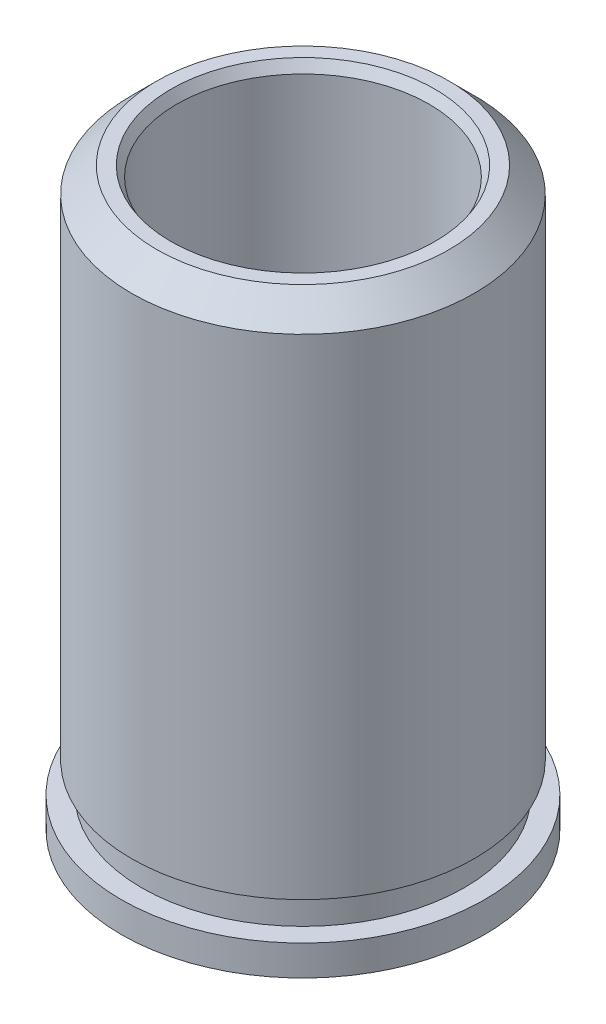
ISO-10303-21;
HEADER;
FILE_DESCRIPTION(('STEP AP214'),'2;1');
FILE_NAME('part.step','',(''),(''),'','','');
FILE_SCHEMA(('AUTOMOTIVE_DESIGN { 1 0 10303 214 1 1 1 1 }'));
ENDSEC;
DATA;
#1=APPLICATION_CONTEXT('core data for automotive mechanical design processes');
#2=APPLICATION_PROTOCOL_DEFINITION('international standard','automotive_design',2000,#1);
#3=PRODUCT_CONTEXT('',#1,'mechanical');
#4=PRODUCT('Part','Part','',(#3));
#5=PRODUCT_RELATED_PRODUCT_CATEGORY('part','',(#4));
#6=PRODUCT_DEFINITION_FORMATION('','',#4);
#7=PRODUCT_DEFINITION_CONTEXT('part definition',#1,'design');
#8=PRODUCT_DEFINITION('design','',#6,#7);
#9=PRODUCT_DEFINITION_SHAPE('','',#8);
#10=(LENGTH_UNIT() NAMED_UNIT(*) SI_UNIT(.MILLI.,.METRE.));
#11=(NAMED_UNIT(*) PLANE_ANGLE_UNIT() SI_UNIT($,.RADIAN.));
#12=(NAMED_UNIT(*) SI_UNIT($,.STERADIAN.) SOLID_ANGLE_UNIT());
#13=UNCERTAINTY_MEASURE_WITH_UNIT(LENGTH_MEASURE(1.E-05),#10,'distance_accuracy_value','');
#14=(GEOMETRIC_REPRESENTATION_CONTEXT(3) GLOBAL_UNCERTAINTY_ASSIGNED_CONTEXT((#13)) GLOBAL_UNIT_ASSIGNED_CONTEXT((#10,
#11,#12)) REPRESENTATION_CONTEXT('',''));
#15=CARTESIAN_POINT('',(0.,0.,0.));
#16=DIRECTION('',(0.,0.,1.));
#17=DIRECTION('',(1.,0.,0.));
#18=AXIS2_PLACEMENT_3D('',#15,#16,#17);
#19=CARTESIAN_POINT('',(0.,7.239,0.));
#20=DIRECTION('',(0.,1.,0.));
#21=DIRECTION('',(0.,0.,1.));
#22=AXIS2_PLACEMENT_3D('',#19,#20,#21);
#23=CYLINDRICAL_SURFACE('',#22,4.572);
#24=CARTESIAN_POINT('',(0.,-7.239,0.));
#25=DIRECTION('',(0.,1.,0.));
#26=DIRECTION('',(0.,0.,1.));
#27=AXIS2_PLACEMENT_3D('',#24,#25,#26);
#28=CIRCLE('',#27,4.572);
#29=CARTESIAN_POINT('',(0.,-7.239,4.572));
#30=VERTEX_POINT('',#29);
#31=EDGE_CURVE('E51',#30,#30,#28,.T.);
#32=ORIENTED_EDGE('',*,*,#31,.T.);
#33=EDGE_LOOP('',(#32));
#34=FACE_BOUND('',#33,.T.);
#35=CARTESIAN_POINT('',(0.,-6.477,0.));
#36=DIRECTION('',(0.,1.,0.));
#37=DIRECTION('',(0.,0.,1.));
#38=AXIS2_PLACEMENT_3D('',#35,#36,#37);
#39=CIRCLE('',#38,4.572);
#40=CARTESIAN_POINT('',(0.,-6.477,4.572));
#41=VERTEX_POINT('',#40);
#42=EDGE_CURVE('E9',#41,#41,#39,.T.);
#43=ORIENTED_EDGE('',*,*,#42,.F.);
#44=EDGE_LOOP('',(#43));
#45=FACE_BOUND('',#44,.T.);
#46=ADVANCED_FACE('F14',(#34,#45),#23,.T.);
#47=CARTESIAN_POINT('',(2.286,-6.477,0.));
#48=DIRECTION('',(0.,1.,0.));
#49=DIRECTION('',(0.,0.,1.));
#50=AXIS2_PLACEMENT_3D('',#47,#48,#49);
#51=PLANE('',#50);
#52=ORIENTED_EDGE('',*,*,#42,.T.);
#53=EDGE_LOOP('',(#52));
#54=FACE_BOUND('',#53,.T.);
#55=CARTESIAN_POINT('',(0.,-6.477,0.));
#56=DIRECTION('',(0.,1.,0.));
#57=DIRECTION('',(0.,0.,1.));
#58=AXIS2_PLACEMENT_3D('',#55,#56,#57);
#59=CIRCLE('',#58,4.05765);
#60=CARTESIAN_POINT('',(0.,-6.477,4.05765));
#61=VERTEX_POINT('',#60);
#62=EDGE_CURVE('E20',#61,#61,#59,.T.);
#63=ORIENTED_EDGE('',*,*,#62,.F.);
#64=EDGE_LOOP('',(#63));
#65=FACE_BOUND('',#64,.T.);
#66=ADVANCED_FACE('F77',(#54,#65),#51,.T.);
#67=CARTESIAN_POINT('',(0.,7.239,0.));
#68=DIRECTION('',(0.,1.,0.));
#69=DIRECTION('',(0.,0.,1.));
#70=AXIS2_PLACEMENT_3D('',#67,#68,#69);
#71=CYLINDRICAL_SURFACE('',#70,4.05765);
#72=ORIENTED_EDGE('',*,*,#62,.T.);
#73=EDGE_LOOP('',(#72));
#74=FACE_BOUND('',#73,.T.);
#75=CARTESIAN_POINT('',(0.,-5.715,0.));
#76=DIRECTION('',(0.,1.,0.));
#77=DIRECTION('',(0.,0.,1.));
#78=AXIS2_PLACEMENT_3D('',#75,#76,#77);
#79=CIRCLE('',#78,4.05765);
#80=CARTESIAN_POINT('',(0.,-5.715,4.05765));
#81=VERTEX_POINT('',#80);
#82=EDGE_CURVE('E24',#81,#81,#79,.T.);
#83=ORIENTED_EDGE('',*,*,#82,.F.);
#84=EDGE_LOOP('',(#83));
#85=FACE_BOUND('',#84,.T.);
#86=ADVANCED_FACE('F82',(#74,#85),#71,.T.);
#87=CARTESIAN_POINT('',(2.286,-5.715,0.));
#88=DIRECTION('',(0.,-1.,0.));
#89=DIRECTION('',(0.,0.,-1.));
#90=AXIS2_PLACEMENT_3D('',#87,#88,#89);
#91=PLANE('',#90);
#92=ORIENTED_EDGE('',*,*,#82,.T.);
#93=EDGE_LOOP('',(#92));
#94=FACE_BOUND('',#93,.T.);
#95=CARTESIAN_POINT('',(0.,-5.715,0.));
#96=DIRECTION('',(0.,1.,0.));
#97=DIRECTION('',(0.,0.,1.));
#98=AXIS2_PLACEMENT_3D('',#95,#96,#97);
#99=CIRCLE('',#98,4.31165);
#100=CARTESIAN_POINT('',(0.,-5.715,4.31165));
#101=VERTEX_POINT('',#100);
#102=EDGE_CURVE('E28',#101,#101,#99,.T.);
#103=ORIENTED_EDGE('',*,*,#102,.F.);
#104=EDGE_LOOP('',(#103));
#105=FACE_BOUND('',#104,.T.);
#106=ADVANCED_FACE('F87',(#94,#105),#91,.T.);
#107=CARTESIAN_POINT('',(0.,7.239,0.));
#108=DIRECTION('',(0.,1.,0.));
#109=DIRECTION('',(0.,0.,1.));
#110=AXIS2_PLACEMENT_3D('',#107,#108,#109);
#111=CYLINDRICAL_SURFACE('',#110,4.31165);
#112=ORIENTED_EDGE('',*,*,#102,.T.);
#113=EDGE_LOOP('',(#112));
#114=FACE_BOUND('',#113,.T.);
#115=CARTESIAN_POINT('',(0.,6.604,0.));
#116=DIRECTION('',(0.,1.,0.));
#117=DIRECTION('',(0.,0.,1.));
#118=AXIS2_PLACEMENT_3D('',#115,#116,#117);
#119=CIRCLE('',#118,4.31164999999999);
#120=CARTESIAN_POINT('',(0.,6.604,4.31164999999999));
#121=VERTEX_POINT('',#120);
#122=EDGE_CURVE('E33',#121,#121,#119,.T.);
#123=ORIENTED_EDGE('',*,*,#122,.F.);
#124=EDGE_LOOP('',(#123));
#125=FACE_BOUND('',#124,.T.);
#126=ADVANCED_FACE('F93',(#114,#125),#111,.T.);
#127=CARTESIAN_POINT('',(0.,7.239,0.));
#128=DIRECTION('',(0.,-1.,0.));
#129=DIRECTION('',(0.,0.,-1.));
#130=AXIS2_PLACEMENT_3D('',#127,#128,#129);
#131=CONICAL_SURFACE('',#130,3.67665,0.785398163397445);
#132=ORIENTED_EDGE('',*,*,#122,.T.);
#133=EDGE_LOOP('',(#132));
#134=FACE_BOUND('',#133,.T.);
#135=CARTESIAN_POINT('',(0.,7.239,0.));
#136=DIRECTION('',(0.,1.,0.));
#137=DIRECTION('',(0.,0.,1.));
#138=AXIS2_PLACEMENT_3D('',#135,#136,#137);
#139=CIRCLE('',#138,3.67665);
#140=CARTESIAN_POINT('',(0.,7.239,3.67665));
#141=VERTEX_POINT('',#140);
#142=EDGE_CURVE('E36',#141,#141,#139,.T.);
#143=ORIENTED_EDGE('',*,*,#142,.F.);
#144=EDGE_LOOP('',(#143));
#145=FACE_BOUND('',#144,.T.);
#146=ADVANCED_FACE('F97',(#134,#145),#131,.T.);
#147=CARTESIAN_POINT('',(2.286,7.239,0.));
#148=DIRECTION('',(0.,1.,0.));
#149=DIRECTION('',(0.,0.,1.));
#150=AXIS2_PLACEMENT_3D('',#147,#148,#149);
#151=PLANE('',#150);
#152=ORIENTED_EDGE('',*,*,#142,.T.);
#153=EDGE_LOOP('',(#152));
#154=FACE_BOUND('',#153,.T.);
#155=CARTESIAN_POINT('',(0.,7.239,0.));
#156=DIRECTION('',(0.,1.,0.));
#157=DIRECTION('',(0.,0.,1.));
#158=AXIS2_PLACEMENT_3D('',#155,#156,#157);
#159=CIRCLE('',#158,3.32164696837416);
#160=CARTESIAN_POINT('',(0.,7.239,3.32164696837416));
#161=VERTEX_POINT('',#160);
#162=EDGE_CURVE('E39',#161,#161,#159,.T.);
#163=ORIENTED_EDGE('',*,*,#162,.F.);
#164=EDGE_LOOP('',(#163));
#165=FACE_BOUND('',#164,.T.);
#166=ADVANCED_FACE('F101',(#154,#165),#151,.T.);
#167=CARTESIAN_POINT('',(0.,6.985,0.));
#168=DIRECTION('',(0.,1.,0.));
#169=DIRECTION('',(0.,0.,1.));
#170=AXIS2_PLACEMENT_3D('',#167,#168,#169);
#171=CONICAL_SURFACE('',#170,3.175,0.523598775598294);
#172=ORIENTED_EDGE('',*,*,#162,.T.);
#173=EDGE_LOOP('',(#172));
#174=FACE_BOUND('',#173,.T.);
#175=CARTESIAN_POINT('',(0.,6.985,0.));
#176=DIRECTION('',(0.,1.,0.));
#177=DIRECTION('',(0.,0.,1.));
#178=AXIS2_PLACEMENT_3D('',#175,#176,#177);
#179=CIRCLE('',#178,3.175);
#180=CARTESIAN_POINT('',(0.,6.985,3.175));
#181=VERTEX_POINT('',#180);
#182=EDGE_CURVE('E42',#181,#181,#179,.T.);
#183=ORIENTED_EDGE('',*,*,#182,.F.);
#184=EDGE_LOOP('',(#183));
#185=FACE_BOUND('',#184,.T.);
#186=ADVANCED_FACE('F73',(#174,#185),#171,.F.);
#187=CARTESIAN_POINT('',(0.,7.239,0.));
#188=DIRECTION('',(0.,1.,0.));
#189=DIRECTION('',(0.,0.,1.));
#190=AXIS2_PLACEMENT_3D('',#187,#188,#189);
#191=CYLINDRICAL_SURFACE('',#190,3.175);
#192=ORIENTED_EDGE('',*,*,#182,.T.);
#193=EDGE_LOOP('',(#192));
#194=FACE_BOUND('',#193,.T.);
#195=CARTESIAN_POINT('',(0.,-6.985,0.));
#196=DIRECTION('',(0.,1.,0.));
#197=DIRECTION('',(0.,0.,1.));
#198=AXIS2_PLACEMENT_3D('',#195,#196,#197);
#199=CIRCLE('',#198,3.175);
#200=CARTESIAN_POINT('',(0.,-6.985,3.175));
#201=VERTEX_POINT('',#200);
#202=EDGE_CURVE('E45',#201,#201,#199,.T.);
#203=ORIENTED_EDGE('',*,*,#202,.F.);
#204=EDGE_LOOP('',(#203));
#205=FACE_BOUND('',#204,.T.);
#206=ADVANCED_FACE('F65',(#194,#205),#191,.F.);
#207=CARTESIAN_POINT('',(0.,-7.239,0.));
#208=DIRECTION('',(0.,-1.,0.));
#209=DIRECTION('',(0.,0.,-1.));
#210=AXIS2_PLACEMENT_3D('',#207,#208,#209);
#211=CONICAL_SURFACE('',#210,3.32164696837416,0.523598775598299);
#212=ORIENTED_EDGE('',*,*,#202,.T.);
#213=EDGE_LOOP('',(#212));
#214=FACE_BOUND('',#213,.T.);
#215=CARTESIAN_POINT('',(0.,-7.239,0.));
#216=DIRECTION('',(0.,1.,0.));
#217=DIRECTION('',(0.,0.,1.));
#218=AXIS2_PLACEMENT_3D('',#215,#216,#217);
#219=CIRCLE('',#218,3.32164696837416);
#220=CARTESIAN_POINT('',(0.,-7.239,3.32164696837416));
#221=VERTEX_POINT('',#220);
#222=EDGE_CURVE('E48',#221,#221,#219,.T.);
#223=ORIENTED_EDGE('',*,*,#222,.F.);
#224=EDGE_LOOP('',(#223));
#225=FACE_BOUND('',#224,.T.);
#226=ADVANCED_FACE('F60',(#214,#225),#211,.F.);
#227=CARTESIAN_POINT('',(2.286,-7.239,0.));
#228=DIRECTION('',(0.,1.,0.));
#229=DIRECTION('',(0.,0.,1.));
#230=AXIS2_PLACEMENT_3D('',#227,#228,#229);
#231=PLANE('',#230);
#232=ORIENTED_EDGE('',*,*,#31,.F.);
#233=EDGE_LOOP('',(#232));
#234=FACE_BOUND('',#233,.T.);
#235=ORIENTED_EDGE('',*,*,#222,.T.);
#236=EDGE_LOOP('',(#235));
#237=FACE_BOUND('',#236,.T.);
#238=ADVANCED_FACE('F57',(#234,#237),#231,.F.);
#239=CLOSED_SHELL('',(#46,#66,#86,#106,#126,#146,#166,#186,#206,#226,#238));
#240=MANIFOLD_SOLID_BREP('B1',#239);
#241=ADVANCED_BREP_SHAPE_REPRESENTATION('',(#18,#240),#14);
#242=SHAPE_DEFINITION_REPRESENTATION(#9,#241);
ENDSEC;
END-ISO-10303-21;
